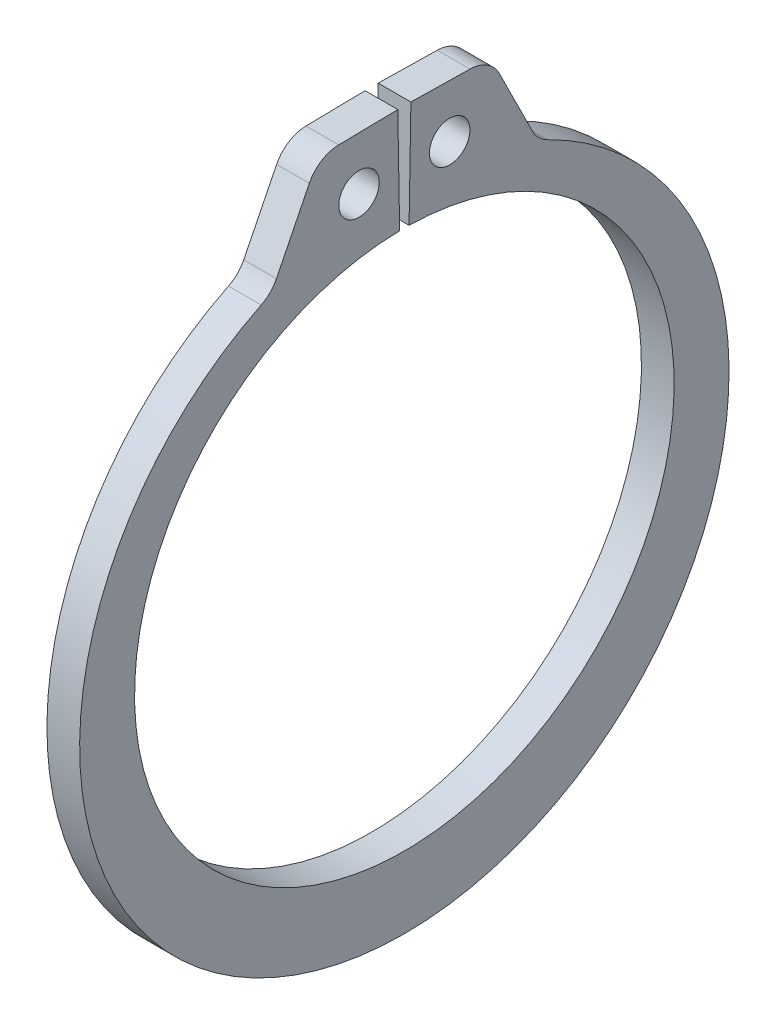
ISO-10303-21;
HEADER;
FILE_DESCRIPTION(('STEP AP214'),'2;1');
FILE_NAME('part.step','',(''),(''),'','','');
FILE_SCHEMA(('AUTOMOTIVE_DESIGN { 1 0 10303 214 1 1 1 1 }'));
ENDSEC;
DATA;
#1=APPLICATION_CONTEXT('core data for automotive mechanical design processes');
#2=APPLICATION_PROTOCOL_DEFINITION('international standard','automotive_design',2000,#1);
#3=PRODUCT_CONTEXT('',#1,'mechanical');
#4=PRODUCT('Part','Part','',(#3));
#5=PRODUCT_RELATED_PRODUCT_CATEGORY('part','',(#4));
#6=PRODUCT_DEFINITION_FORMATION('','',#4);
#7=PRODUCT_DEFINITION_CONTEXT('part definition',#1,'design');
#8=PRODUCT_DEFINITION('design','',#6,#7);
#9=PRODUCT_DEFINITION_SHAPE('','',#8);
#10=(LENGTH_UNIT() NAMED_UNIT(*) SI_UNIT(.MILLI.,.METRE.));
#11=(NAMED_UNIT(*) PLANE_ANGLE_UNIT() SI_UNIT($,.RADIAN.));
#12=(NAMED_UNIT(*) SI_UNIT($,.STERADIAN.) SOLID_ANGLE_UNIT());
#13=UNCERTAINTY_MEASURE_WITH_UNIT(LENGTH_MEASURE(1.E-05),#10,'distance_accuracy_value','');
#14=(GEOMETRIC_REPRESENTATION_CONTEXT(3) GLOBAL_UNCERTAINTY_ASSIGNED_CONTEXT((#13)) GLOBAL_UNIT_ASSIGNED_CONTEXT((#10,
#11,#12)) REPRESENTATION_CONTEXT('',''));
#15=CARTESIAN_POINT('',(0.,0.,0.));
#16=DIRECTION('',(0.,0.,1.));
#17=DIRECTION('',(1.,0.,0.));
#18=AXIS2_PLACEMENT_3D('',#15,#16,#17);
#19=CARTESIAN_POINT('',(0.5334,0.,0.));
#20=DIRECTION('',(1.,0.,0.));
#21=DIRECTION('',(0.,0.,-1.));
#22=AXIS2_PLACEMENT_3D('',#19,#20,#21);
#23=PLANE('',#22);
#24=CARTESIAN_POINT('',(0.5334,10.5040886416162,1.47894687499925));
#25=DIRECTION('',(1.,0.,0.));
#26=DIRECTION('',(0.,0.,-1.));
#27=AXIS2_PLACEMENT_3D('',#24,#25,#26);
#28=CIRCLE('',#27,0.6604);
#29=CARTESIAN_POINT('',(0.5334,10.5040886416162,0.818546874999249));
#30=VERTEX_POINT('',#29);
#31=EDGE_CURVE('E222',#30,#30,#28,.T.);
#32=ORIENTED_EDGE('',*,*,#31,.F.);
#33=EDGE_LOOP('',(#32));
#34=FACE_BOUND('',#33,.T.);
#35=DIRECTION('',(0.,-0.0174524064372888,0.999847695156391));
#36=VECTOR('',#35,1.);
#37=CARTESIAN_POINT('',(0.5334,12.2536334279892,0.213887967092128));
#38=LINE('',#37,#36);
#39=CARTESIAN_POINT('',(0.5334,12.2536334279892,0.213887967092128));
#40=VERTEX_POINT('',#39);
#41=CARTESIAN_POINT('',(0.5334,12.21999978275,2.14075821234739));
#42=VERTEX_POINT('',#41);
#43=EDGE_CURVE('E134',#40,#42,#38,.T.);
#44=ORIENTED_EDGE('',*,*,#43,.T.);
#45=CARTESIAN_POINT('',(0.5334,11.1279661301002,2.12169669403658));
#46=DIRECTION('',(1.,0.,0.));
#47=DIRECTION('',(0.,0.,-1.));
#48=AXIS2_PLACEMENT_3D('',#45,#46,#47);
#49=CIRCLE('',#48,1.0922);
#50=CARTESIAN_POINT('',(0.5334,11.6141614114107,3.09971253666458));
#51=VERTEX_POINT('',#50);
#52=EDGE_CURVE('E175',#42,#51,#49,.T.);
#53=ORIENTED_EDGE('',*,*,#52,.T.);
#54=DIRECTION('',(0.,-0.895454900776411,0.445152244378829));
#55=VECTOR('',#54,1.);
#56=CARTESIAN_POINT('',(0.5334,12.2084177333914,2.80429337570331));
#57=LINE('',#56,#55);
#58=CARTESIAN_POINT('',(0.5334,9.45539137797144,4.17288922557434));
#59=VERTEX_POINT('',#58);
#60=EDGE_CURVE('E214',#51,#59,#57,.T.);
#61=ORIENTED_EDGE('',*,*,#60,.T.);
#62=CARTESIAN_POINT('',(0.5334,9.941586659282,5.15090506820234));
#63=DIRECTION('',(1.,0.,0.));
#64=DIRECTION('',(0.,0.,-1.));
#65=AXIS2_PLACEMENT_3D('',#62,#63,#64);
#66=CIRCLE('',#65,1.0922);
#67=CARTESIAN_POINT('',(0.5334,8.96124610534802,4.66941442622431));
#68=VERTEX_POINT('',#67);
#69=EDGE_CURVE('E182',#59,#68,#66,.F.);
#70=ORIENTED_EDGE('',*,*,#69,.T.);
#71=CARTESIAN_POINT('',(0.5334,-0.545929997486655,0.));
#72=DIRECTION('',(1.,0.,0.));
#73=DIRECTION('',(0.,0.,-1.));
#74=AXIS2_PLACEMENT_3D('',#71,#72,#73);
#75=CIRCLE('',#74,10.5919700025133);
#76=CARTESIAN_POINT('',(0.5334,8.96124610534802,-4.66941442622431));
#77=VERTEX_POINT('',#76);
#78=EDGE_CURVE('E207',#68,#77,#75,.T.);
#79=ORIENTED_EDGE('',*,*,#78,.T.);
#80=CARTESIAN_POINT('',(0.5334,9.941586659282,-5.15090506820234));
#81=DIRECTION('',(1.,0.,0.));
#82=DIRECTION('',(0.,0.,-1.));
#83=AXIS2_PLACEMENT_3D('',#80,#81,#82);
#84=CIRCLE('',#83,1.0922);
#85=CARTESIAN_POINT('',(0.5334,9.45539137797144,-4.17288922557434));
#86=VERTEX_POINT('',#85);
#87=EDGE_CURVE('E11',#77,#86,#84,.F.);
#88=ORIENTED_EDGE('',*,*,#87,.T.);
#89=DIRECTION('',(0.,0.895454900776411,0.445152244378829));
#90=VECTOR('',#89,1.);
#91=CARTESIAN_POINT('',(0.5334,12.2084177333914,-2.80429337570331));
#92=LINE('',#91,#90);
#93=CARTESIAN_POINT('',(0.5334,11.6141614114107,-3.09971253666458));
#94=VERTEX_POINT('',#93);
#95=EDGE_CURVE('E206',#86,#94,#92,.T.);
#96=ORIENTED_EDGE('',*,*,#95,.T.);
#97=CARTESIAN_POINT('',(0.5334,11.1279661301002,-2.12169669403658));
#98=DIRECTION('',(1.,0.,0.));
#99=DIRECTION('',(0.,0.,-1.));
#100=AXIS2_PLACEMENT_3D('',#97,#98,#99);
#101=CIRCLE('',#100,1.0922);
#102=CARTESIAN_POINT('',(0.5334,12.21999978275,-2.14075821234739));
#103=VERTEX_POINT('',#102);
#104=EDGE_CURVE('E50',#94,#103,#101,.T.);
#105=ORIENTED_EDGE('',*,*,#104,.T.);
#106=DIRECTION('',(0.,0.0174524064372888,0.999847695156391));
#107=VECTOR('',#106,1.);
#108=CARTESIAN_POINT('',(0.5334,12.2536334279892,-0.213887967092128));
#109=LINE('',#108,#107);
#110=CARTESIAN_POINT('',(0.5334,12.2536334279892,-0.213887967092128));
#111=VERTEX_POINT('',#110);
#112=EDGE_CURVE('E211',#103,#111,#109,.T.);
#113=ORIENTED_EDGE('',*,*,#112,.T.);
#114=DIRECTION('',(0.,-0.999847695156391,0.0174524064372835));
#115=VECTOR('',#114,1.);
#116=CARTESIAN_POINT('',(0.5334,8.79975954984091,-0.153600374295176));
#117=LINE('',#116,#115);
#118=CARTESIAN_POINT('',(0.5334,8.79975954984091,-0.153600374295176));
#119=VERTEX_POINT('',#118);
#120=EDGE_CURVE('E140',#111,#119,#117,.T.);
#121=ORIENTED_EDGE('',*,*,#120,.T.);
#122=CARTESIAN_POINT('',(0.5334,0.,0.));
#123=DIRECTION('',(-1.,0.,0.));
#124=DIRECTION('',(0.,0.,-1.));
#125=AXIS2_PLACEMENT_3D('',#122,#123,#124);
#126=CIRCLE('',#125,8.8011);
#127=CARTESIAN_POINT('',(0.5334,8.79975954984091,0.153600374295176));
#128=VERTEX_POINT('',#127);
#129=EDGE_CURVE('E135',#119,#128,#126,.T.);
#130=ORIENTED_EDGE('',*,*,#129,.T.);
#131=DIRECTION('',(0.,0.999847695156391,0.0174524064372835));
#132=VECTOR('',#131,1.);
#133=CARTESIAN_POINT('',(0.5334,8.79975954984091,0.153600374295176));
#134=LINE('',#133,#132);
#135=EDGE_CURVE('E126',#128,#40,#134,.T.);
#136=ORIENTED_EDGE('',*,*,#135,.T.);
#137=EDGE_LOOP('',(#44,#53,#61,#70,#79,#88,#96,#105,#113,#121,#130,#136));
#138=FACE_BOUND('',#137,.T.);
#139=CARTESIAN_POINT('',(0.5334,10.5040886416162,-1.47894687499925));
#140=DIRECTION('',(1.,0.,0.));
#141=DIRECTION('',(0.,0.,-1.));
#142=AXIS2_PLACEMENT_3D('',#139,#140,#141);
#143=CIRCLE('',#142,0.6604);
#144=CARTESIAN_POINT('',(0.5334,10.5040886416162,-2.13934687499925));
#145=VERTEX_POINT('',#144);
#146=EDGE_CURVE('E248',#145,#145,#143,.T.);
#147=ORIENTED_EDGE('',*,*,#146,.F.);
#148=EDGE_LOOP('',(#147));
#149=FACE_BOUND('',#148,.T.);
#150=ADVANCED_FACE('F35',(#34,#138,#149),#23,.T.);
#151=CARTESIAN_POINT('',(-0.5334,0.,0.));
#152=DIRECTION('',(1.,0.,0.));
#153=DIRECTION('',(0.,0.,-1.));
#154=AXIS2_PLACEMENT_3D('',#151,#152,#153);
#155=PLANE('',#154);
#156=CARTESIAN_POINT('',(-0.5334,10.5040886416162,1.47894687499925));
#157=DIRECTION('',(1.,0.,0.));
#158=DIRECTION('',(0.,0.,-1.));
#159=AXIS2_PLACEMENT_3D('',#156,#157,#158);
#160=CIRCLE('',#159,0.6604);
#161=CARTESIAN_POINT('',(-0.5334,10.5040886416162,0.818546874999249));
#162=VERTEX_POINT('',#161);
#163=EDGE_CURVE('E245',#162,#162,#160,.T.);
#164=ORIENTED_EDGE('',*,*,#163,.T.);
#165=EDGE_LOOP('',(#164));
#166=FACE_BOUND('',#165,.T.);
#167=DIRECTION('',(0.,-0.895454900776411,0.445152244378829));
#168=VECTOR('',#167,1.);
#169=CARTESIAN_POINT('',(-0.5334,12.2084177333914,2.80429337570331));
#170=LINE('',#169,#168);
#171=CARTESIAN_POINT('',(-0.5334,11.6141614114107,3.09971253666458));
#172=VERTEX_POINT('',#171);
#173=CARTESIAN_POINT('',(-0.5334,9.45539137797144,4.17288922557434));
#174=VERTEX_POINT('',#173);
#175=EDGE_CURVE('E201',#172,#174,#170,.T.);
#176=ORIENTED_EDGE('',*,*,#175,.F.);
#177=CARTESIAN_POINT('',(-0.5334,11.1279661301002,2.12169669403658));
#178=DIRECTION('',(1.,0.,0.));
#179=DIRECTION('',(0.,0.,-1.));
#180=AXIS2_PLACEMENT_3D('',#177,#178,#179);
#181=CIRCLE('',#180,1.0922);
#182=CARTESIAN_POINT('',(-0.5334,12.21999978275,2.14075821234739));
#183=VERTEX_POINT('',#182);
#184=EDGE_CURVE('E171',#172,#183,#181,.F.);
#185=ORIENTED_EDGE('',*,*,#184,.T.);
#186=DIRECTION('',(0.,-0.0174524064372888,0.999847695156391));
#187=VECTOR('',#186,1.);
#188=CARTESIAN_POINT('',(-0.5334,12.2536334279892,0.213887967092128));
#189=LINE('',#188,#187);
#190=CARTESIAN_POINT('',(-0.5334,12.2536334279892,0.213887967092128));
#191=VERTEX_POINT('',#190);
#192=EDGE_CURVE('E224',#191,#183,#189,.T.);
#193=ORIENTED_EDGE('',*,*,#192,.F.);
#194=DIRECTION('',(0.,0.999847695156391,0.0174524064372835));
#195=VECTOR('',#194,1.);
#196=CARTESIAN_POINT('',(-0.5334,8.79975954984091,0.153600374295176));
#197=LINE('',#196,#195);
#198=CARTESIAN_POINT('',(-0.5334,8.79975954984091,0.153600374295176));
#199=VERTEX_POINT('',#198);
#200=EDGE_CURVE('E221',#199,#191,#197,.T.);
#201=ORIENTED_EDGE('',*,*,#200,.F.);
#202=CARTESIAN_POINT('',(-0.5334,0.,0.));
#203=DIRECTION('',(-1.,0.,0.));
#204=DIRECTION('',(0.,0.,-1.));
#205=AXIS2_PLACEMENT_3D('',#202,#203,#204);
#206=CIRCLE('',#205,8.8011);
#207=CARTESIAN_POINT('',(-0.5334,8.79975954984091,-0.153600374295176));
#208=VERTEX_POINT('',#207);
#209=EDGE_CURVE('E148',#208,#199,#206,.T.);
#210=ORIENTED_EDGE('',*,*,#209,.F.);
#211=DIRECTION('',(0.,-0.999847695156391,0.0174524064372835));
#212=VECTOR('',#211,1.);
#213=CARTESIAN_POINT('',(-0.5334,8.79975954984091,-0.153600374295176));
#214=LINE('',#213,#212);
#215=CARTESIAN_POINT('',(-0.5334,12.2536334279892,-0.213887967092128));
#216=VERTEX_POINT('',#215);
#217=EDGE_CURVE('E144',#216,#208,#214,.T.);
#218=ORIENTED_EDGE('',*,*,#217,.F.);
#219=DIRECTION('',(0.,0.0174524064372888,0.999847695156391));
#220=VECTOR('',#219,1.);
#221=CARTESIAN_POINT('',(-0.5334,12.2536334279892,-0.213887967092128));
#222=LINE('',#221,#220);
#223=CARTESIAN_POINT('',(-0.5334,12.21999978275,-2.14075821234739));
#224=VERTEX_POINT('',#223);
#225=EDGE_CURVE('E229',#224,#216,#222,.T.);
#226=ORIENTED_EDGE('',*,*,#225,.F.);
#227=CARTESIAN_POINT('',(-0.5334,11.1279661301002,-2.12169669403658));
#228=DIRECTION('',(1.,0.,0.));
#229=DIRECTION('',(0.,0.,-1.));
#230=AXIS2_PLACEMENT_3D('',#227,#228,#229);
#231=CIRCLE('',#230,1.0922);
#232=CARTESIAN_POINT('',(-0.5334,11.6141614114107,-3.09971253666458));
#233=VERTEX_POINT('',#232);
#234=EDGE_CURVE('E169',#224,#233,#231,.F.);
#235=ORIENTED_EDGE('',*,*,#234,.T.);
#236=DIRECTION('',(0.,0.895454900776411,0.445152244378829));
#237=VECTOR('',#236,1.);
#238=CARTESIAN_POINT('',(-0.5334,12.2084177333914,-2.80429337570331));
#239=LINE('',#238,#237);
#240=CARTESIAN_POINT('',(-0.5334,9.45539137797144,-4.17288922557434));
#241=VERTEX_POINT('',#240);
#242=EDGE_CURVE('E192',#241,#233,#239,.T.);
#243=ORIENTED_EDGE('',*,*,#242,.F.);
#244=CARTESIAN_POINT('',(-0.5334,9.941586659282,-5.15090506820234));
#245=DIRECTION('',(1.,0.,0.));
#246=DIRECTION('',(0.,0.,-1.));
#247=AXIS2_PLACEMENT_3D('',#244,#245,#246);
#248=CIRCLE('',#247,1.0922);
#249=CARTESIAN_POINT('',(-0.5334,8.96124610534802,-4.66941442622431));
#250=VERTEX_POINT('',#249);
#251=EDGE_CURVE('E43',#241,#250,#248,.T.);
#252=ORIENTED_EDGE('',*,*,#251,.T.);
#253=CARTESIAN_POINT('',(-0.5334,-0.545929997486655,0.));
#254=DIRECTION('',(1.,0.,0.));
#255=DIRECTION('',(0.,0.,-1.));
#256=AXIS2_PLACEMENT_3D('',#253,#254,#255);
#257=CIRCLE('',#256,10.5919700025133);
#258=CARTESIAN_POINT('',(-0.5334,8.96124610534802,4.66941442622431));
#259=VERTEX_POINT('',#258);
#260=EDGE_CURVE('E190',#259,#250,#257,.T.);
#261=ORIENTED_EDGE('',*,*,#260,.F.);
#262=CARTESIAN_POINT('',(-0.5334,9.941586659282,5.15090506820234));
#263=DIRECTION('',(1.,0.,0.));
#264=DIRECTION('',(0.,0.,-1.));
#265=AXIS2_PLACEMENT_3D('',#262,#263,#264);
#266=CIRCLE('',#265,1.0922);
#267=EDGE_CURVE('E180',#259,#174,#266,.T.);
#268=ORIENTED_EDGE('',*,*,#267,.T.);
#269=EDGE_LOOP('',(#176,#185,#193,#201,#210,#218,#226,#235,#243,#252,#261,#268));
#270=FACE_BOUND('',#269,.T.);
#271=CARTESIAN_POINT('',(-0.5334,10.5040886416162,-1.47894687499925));
#272=DIRECTION('',(1.,0.,0.));
#273=DIRECTION('',(0.,0.,-1.));
#274=AXIS2_PLACEMENT_3D('',#271,#272,#273);
#275=CIRCLE('',#274,0.6604);
#276=CARTESIAN_POINT('',(-0.5334,10.5040886416162,-2.13934687499925));
#277=VERTEX_POINT('',#276);
#278=EDGE_CURVE('E251',#277,#277,#275,.T.);
#279=ORIENTED_EDGE('',*,*,#278,.T.);
#280=EDGE_LOOP('',(#279));
#281=FACE_BOUND('',#280,.T.);
#282=ADVANCED_FACE('F188',(#166,#270,#281),#155,.F.);
#283=CARTESIAN_POINT('',(0.5334,0.,0.));
#284=DIRECTION('',(-1.,0.,0.));
#285=DIRECTION('',(0.,0.,1.));
#286=AXIS2_PLACEMENT_3D('',#283,#284,#285);
#287=CYLINDRICAL_SURFACE('',#286,8.8011);
#288=ORIENTED_EDGE('',*,*,#209,.T.);
#289=DIRECTION('',(-1.,0.,0.));
#290=VECTOR('',#289,1.);
#291=CARTESIAN_POINT('',(0.5334,8.79975954984091,0.153600374295176));
#292=LINE('',#291,#290);
#293=EDGE_CURVE('E130',#128,#199,#292,.T.);
#294=ORIENTED_EDGE('',*,*,#293,.F.);
#295=ORIENTED_EDGE('',*,*,#129,.F.);
#296=DIRECTION('',(-1.,0.,0.));
#297=VECTOR('',#296,1.);
#298=CARTESIAN_POINT('',(0.5334,8.79975954984091,-0.153600374295176));
#299=LINE('',#298,#297);
#300=EDGE_CURVE('E219',#119,#208,#299,.T.);
#301=ORIENTED_EDGE('',*,*,#300,.T.);
#302=EDGE_LOOP('',(#288,#294,#295,#301));
#303=FACE_BOUND('',#302,.T.);
#304=ADVANCED_FACE('F146',(#303),#287,.F.);
#305=CARTESIAN_POINT('',(0.5334,8.79975954984091,0.153600374295176));
#306=DIRECTION('',(0.,-0.0174524064372835,0.999847695156391));
#307=DIRECTION('',(0.,-0.999847695156391,-0.0174524064372835));
#308=AXIS2_PLACEMENT_3D('',#305,#306,#307);
#309=PLANE('',#308);
#310=ORIENTED_EDGE('',*,*,#200,.T.);
#311=DIRECTION('',(-1.,0.,0.));
#312=VECTOR('',#311,1.);
#313=CARTESIAN_POINT('',(0.5334,12.2536334279892,0.213887967092128));
#314=LINE('',#313,#312);
#315=EDGE_CURVE('E133',#40,#191,#314,.T.);
#316=ORIENTED_EDGE('',*,*,#315,.F.);
#317=ORIENTED_EDGE('',*,*,#135,.F.);
#318=ORIENTED_EDGE('',*,*,#293,.T.);
#319=EDGE_LOOP('',(#310,#316,#317,#318));
#320=FACE_BOUND('',#319,.T.);
#321=ADVANCED_FACE('F128',(#320),#309,.F.);
#322=CARTESIAN_POINT('',(0.5334,12.2536334279892,0.213887967092128));
#323=DIRECTION('',(0.,-0.999847695156391,-0.0174524064372888));
#324=DIRECTION('',(0.,0.0174524064372888,-0.999847695156391));
#325=AXIS2_PLACEMENT_3D('',#322,#323,#324);
#326=PLANE('',#325);
#327=ORIENTED_EDGE('',*,*,#192,.T.);
#328=DIRECTION('',(-1.,0.,0.));
#329=VECTOR('',#328,1.);
#330=CARTESIAN_POINT('',(0.5334,12.21999978275,2.14075821234739));
#331=LINE('',#330,#329);
#332=EDGE_CURVE('E58',#183,#42,#331,.F.);
#333=ORIENTED_EDGE('',*,*,#332,.T.);
#334=ORIENTED_EDGE('',*,*,#43,.F.);
#335=ORIENTED_EDGE('',*,*,#315,.T.);
#336=EDGE_LOOP('',(#327,#333,#334,#335));
#337=FACE_BOUND('',#336,.T.);
#338=ADVANCED_FACE('F240',(#337),#326,.F.);
#339=CARTESIAN_POINT('',(0.5334,12.2084177333914,2.80429337570331));
#340=DIRECTION('',(0.,-0.445152244378829,-0.895454900776411));
#341=DIRECTION('',(0.,0.895454900776411,-0.445152244378829));
#342=AXIS2_PLACEMENT_3D('',#339,#340,#341);
#343=PLANE('',#342);
#344=ORIENTED_EDGE('',*,*,#175,.T.);
#345=DIRECTION('',(1.,0.,0.));
#346=VECTOR('',#345,1.);
#347=CARTESIAN_POINT('',(0.5334,9.45539137797144,4.17288922557434));
#348=LINE('',#347,#346);
#349=EDGE_CURVE('E162',#174,#59,#348,.T.);
#350=ORIENTED_EDGE('',*,*,#349,.T.);
#351=ORIENTED_EDGE('',*,*,#60,.F.);
#352=DIRECTION('',(-1.,0.,0.));
#353=VECTOR('',#352,1.);
#354=CARTESIAN_POINT('',(0.5334,11.6141614114107,3.09971253666458));
#355=LINE('',#354,#353);
#356=EDGE_CURVE('E159',#51,#172,#355,.T.);
#357=ORIENTED_EDGE('',*,*,#356,.T.);
#358=EDGE_LOOP('',(#344,#350,#351,#357));
#359=FACE_BOUND('',#358,.T.);
#360=ADVANCED_FACE('F281',(#359),#343,.F.);
#361=CARTESIAN_POINT('',(0.5334,-0.545929997486655,0.));
#362=DIRECTION('',(-1.,0.,0.));
#363=DIRECTION('',(0.,0.,1.));
#364=AXIS2_PLACEMENT_3D('',#361,#362,#363);
#365=CYLINDRICAL_SURFACE('',#364,10.5919700025133);
#366=ORIENTED_EDGE('',*,*,#78,.F.);
#367=DIRECTION('',(-1.,0.,0.));
#368=VECTOR('',#367,1.);
#369=CARTESIAN_POINT('',(0.5334,8.96124610534802,4.66941442622431));
#370=LINE('',#369,#368);
#371=EDGE_CURVE('E151',#68,#259,#370,.T.);
#372=ORIENTED_EDGE('',*,*,#371,.T.);
#373=ORIENTED_EDGE('',*,*,#260,.T.);
#374=DIRECTION('',(-1.,0.,0.));
#375=VECTOR('',#374,1.);
#376=CARTESIAN_POINT('',(0.5334,8.96124610534802,-4.66941442622431));
#377=LINE('',#376,#375);
#378=EDGE_CURVE('E149',#250,#77,#377,.F.);
#379=ORIENTED_EDGE('',*,*,#378,.T.);
#380=EDGE_LOOP('',(#366,#372,#373,#379));
#381=FACE_BOUND('',#380,.T.);
#382=ADVANCED_FACE('F198',(#381),#365,.T.);
#383=CARTESIAN_POINT('',(0.5334,12.2084177333914,-2.80429337570331));
#384=DIRECTION('',(0.,-0.445152244378829,0.895454900776411));
#385=DIRECTION('',(0.,-0.895454900776411,-0.445152244378829));
#386=AXIS2_PLACEMENT_3D('',#383,#384,#385);
#387=PLANE('',#386);
#388=ORIENTED_EDGE('',*,*,#95,.F.);
#389=DIRECTION('',(1.,0.,0.));
#390=VECTOR('',#389,1.);
#391=CARTESIAN_POINT('',(-0.5334,9.45539137797144,-4.17288922557434));
#392=LINE('',#391,#390);
#393=EDGE_CURVE('E166',#86,#241,#392,.F.);
#394=ORIENTED_EDGE('',*,*,#393,.T.);
#395=ORIENTED_EDGE('',*,*,#242,.T.);
#396=DIRECTION('',(-1.,0.,0.));
#397=VECTOR('',#396,1.);
#398=CARTESIAN_POINT('',(0.5334,11.6141614114107,-3.09971253666458));
#399=LINE('',#398,#397);
#400=EDGE_CURVE('E164',#233,#94,#399,.F.);
#401=ORIENTED_EDGE('',*,*,#400,.T.);
#402=EDGE_LOOP('',(#388,#394,#395,#401));
#403=FACE_BOUND('',#402,.T.);
#404=ADVANCED_FACE('F209',(#403),#387,.F.);
#405=CARTESIAN_POINT('',(0.5334,12.2536334279892,-0.213887967092128));
#406=DIRECTION('',(0.,-0.999847695156391,0.0174524064372888));
#407=DIRECTION('',(0.,-0.0174524064372888,-0.999847695156391));
#408=AXIS2_PLACEMENT_3D('',#405,#406,#407);
#409=PLANE('',#408);
#410=ORIENTED_EDGE('',*,*,#112,.F.);
#411=DIRECTION('',(-1.,0.,0.));
#412=VECTOR('',#411,1.);
#413=CARTESIAN_POINT('',(0.5334,12.21999978275,-2.14075821234739));
#414=LINE('',#413,#412);
#415=EDGE_CURVE('E177',#103,#224,#414,.T.);
#416=ORIENTED_EDGE('',*,*,#415,.T.);
#417=ORIENTED_EDGE('',*,*,#225,.T.);
#418=DIRECTION('',(-1.,0.,0.));
#419=VECTOR('',#418,1.);
#420=CARTESIAN_POINT('',(0.5334,12.2536334279892,-0.213887967092128));
#421=LINE('',#420,#419);
#422=EDGE_CURVE('E153',#111,#216,#421,.T.);
#423=ORIENTED_EDGE('',*,*,#422,.F.);
#424=EDGE_LOOP('',(#410,#416,#417,#423));
#425=FACE_BOUND('',#424,.T.);
#426=ADVANCED_FACE('F274',(#425),#409,.F.);
#427=CARTESIAN_POINT('',(0.5334,8.79975954984091,-0.153600374295176));
#428=DIRECTION('',(0.,-0.0174524064372835,-0.999847695156391));
#429=DIRECTION('',(0.,0.999847695156391,-0.0174524064372835));
#430=AXIS2_PLACEMENT_3D('',#427,#428,#429);
#431=PLANE('',#430);
#432=ORIENTED_EDGE('',*,*,#217,.T.);
#433=ORIENTED_EDGE('',*,*,#300,.F.);
#434=ORIENTED_EDGE('',*,*,#120,.F.);
#435=ORIENTED_EDGE('',*,*,#422,.T.);
#436=EDGE_LOOP('',(#432,#433,#434,#435));
#437=FACE_BOUND('',#436,.T.);
#438=ADVANCED_FACE('F236',(#437),#431,.F.);
#439=CARTESIAN_POINT('',(0.5334,10.5040886416162,1.47894687499925));
#440=DIRECTION('',(-1.,0.,0.));
#441=DIRECTION('',(0.,0.,1.));
#442=AXIS2_PLACEMENT_3D('',#439,#440,#441);
#443=CYLINDRICAL_SURFACE('',#442,0.6604);
#444=ORIENTED_EDGE('',*,*,#31,.T.);
#445=EDGE_LOOP('',(#444));
#446=FACE_BOUND('',#445,.T.);
#447=ORIENTED_EDGE('',*,*,#163,.F.);
#448=EDGE_LOOP('',(#447));
#449=FACE_BOUND('',#448,.T.);
#450=ADVANCED_FACE('F269',(#446,#449),#443,.F.);
#451=CARTESIAN_POINT('',(0.5334,10.5040886416162,-1.47894687499925));
#452=DIRECTION('',(-1.,0.,0.));
#453=DIRECTION('',(0.,0.,1.));
#454=AXIS2_PLACEMENT_3D('',#451,#452,#453);
#455=CYLINDRICAL_SURFACE('',#454,0.6604);
#456=ORIENTED_EDGE('',*,*,#146,.T.);
#457=EDGE_LOOP('',(#456));
#458=FACE_BOUND('',#457,.T.);
#459=ORIENTED_EDGE('',*,*,#278,.F.);
#460=EDGE_LOOP('',(#459));
#461=FACE_BOUND('',#460,.T.);
#462=ADVANCED_FACE('F257',(#458,#461),#455,.F.);
#463=CARTESIAN_POINT('',(0.5334,9.941586659282,5.15090506820234));
#464=DIRECTION('',(-1.,0.,0.));
#465=DIRECTION('',(0.,0.,1.));
#466=AXIS2_PLACEMENT_3D('',#463,#464,#465);
#467=CYLINDRICAL_SURFACE('',#466,1.0922);
#468=ORIENTED_EDGE('',*,*,#69,.F.);
#469=ORIENTED_EDGE('',*,*,#349,.F.);
#470=ORIENTED_EDGE('',*,*,#267,.F.);
#471=ORIENTED_EDGE('',*,*,#371,.F.);
#472=EDGE_LOOP('',(#468,#469,#470,#471));
#473=FACE_BOUND('',#472,.T.);
#474=ADVANCED_FACE('F291',(#473),#467,.F.);
#475=CARTESIAN_POINT('',(0.5334,9.941586659282,-5.15090506820234));
#476=DIRECTION('',(-1.,0.,0.));
#477=DIRECTION('',(0.,0.,1.));
#478=AXIS2_PLACEMENT_3D('',#475,#476,#477);
#479=CYLINDRICAL_SURFACE('',#478,1.0922);
#480=ORIENTED_EDGE('',*,*,#87,.F.);
#481=ORIENTED_EDGE('',*,*,#378,.F.);
#482=ORIENTED_EDGE('',*,*,#251,.F.);
#483=ORIENTED_EDGE('',*,*,#393,.F.);
#484=EDGE_LOOP('',(#480,#481,#482,#483));
#485=FACE_BOUND('',#484,.T.);
#486=ADVANCED_FACE('F204',(#485),#479,.F.);
#487=CARTESIAN_POINT('',(0.5334,11.1279661301002,2.12169669403658));
#488=DIRECTION('',(-1.,0.,0.));
#489=DIRECTION('',(0.,0.,1.));
#490=AXIS2_PLACEMENT_3D('',#487,#488,#489);
#491=CYLINDRICAL_SURFACE('',#490,1.0922);
#492=ORIENTED_EDGE('',*,*,#52,.F.);
#493=ORIENTED_EDGE('',*,*,#332,.F.);
#494=ORIENTED_EDGE('',*,*,#184,.F.);
#495=ORIENTED_EDGE('',*,*,#356,.F.);
#496=EDGE_LOOP('',(#492,#493,#494,#495));
#497=FACE_BOUND('',#496,.T.);
#498=ADVANCED_FACE('F296',(#497),#491,.T.);
#499=CARTESIAN_POINT('',(0.5334,11.1279661301002,-2.12169669403658));
#500=DIRECTION('',(-1.,0.,0.));
#501=DIRECTION('',(0.,0.,1.));
#502=AXIS2_PLACEMENT_3D('',#499,#500,#501);
#503=CYLINDRICAL_SURFACE('',#502,1.0922);
#504=ORIENTED_EDGE('',*,*,#104,.F.);
#505=ORIENTED_EDGE('',*,*,#400,.F.);
#506=ORIENTED_EDGE('',*,*,#234,.F.);
#507=ORIENTED_EDGE('',*,*,#415,.F.);
#508=EDGE_LOOP('',(#504,#505,#506,#507));
#509=FACE_BOUND('',#508,.T.);
#510=ADVANCED_FACE('F37',(#509),#503,.T.);
#511=CLOSED_SHELL('',(#150,#282,#304,#321,#338,#360,#382,#404,#426,#438,#450,#462,#474,#486,
#498,#510));
#512=MANIFOLD_SOLID_BREP('B2',#511);
#513=ADVANCED_BREP_SHAPE_REPRESENTATION('',(#18,#512),#14);
#514=SHAPE_DEFINITION_REPRESENTATION(#9,#513);
ENDSEC;
END-ISO-10303-21;
